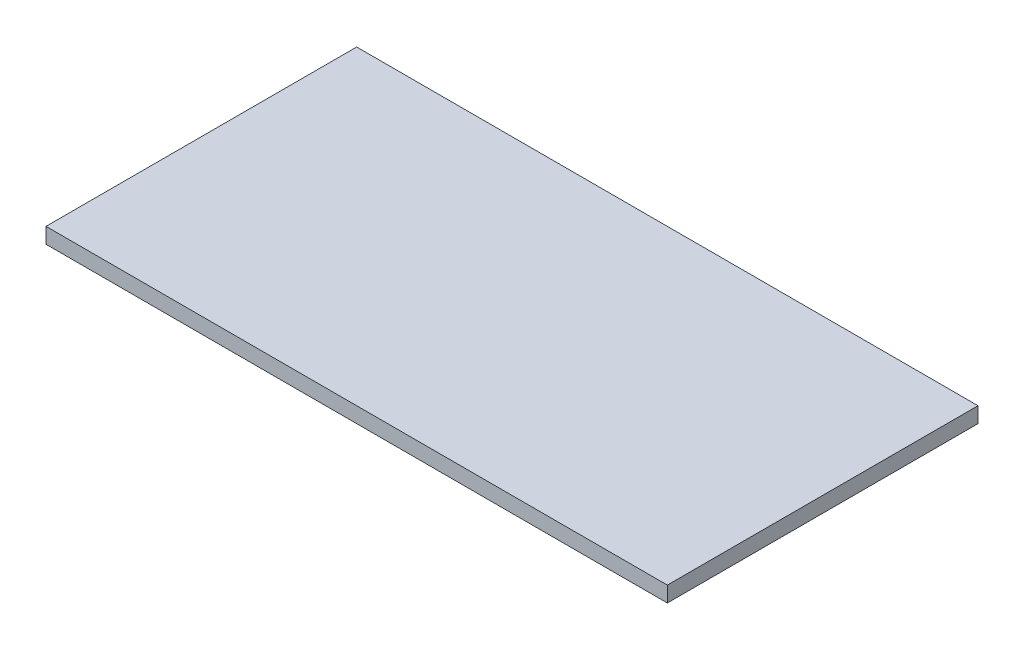
ISO-10303-21;
HEADER;
FILE_DESCRIPTION(('STEP AP214'),'2;1');
FILE_NAME('part.step','',(''),(''),'','','');
FILE_SCHEMA(('AUTOMOTIVE_DESIGN { 1 0 10303 214 1 1 1 1 }'));
ENDSEC;
DATA;
#1=APPLICATION_CONTEXT('core data for automotive mechanical design processes');
#2=APPLICATION_PROTOCOL_DEFINITION('international standard','automotive_design',2000,#1);
#3=PRODUCT_CONTEXT('',#1,'mechanical');
#4=PRODUCT('Part','Part','',(#3));
#5=PRODUCT_RELATED_PRODUCT_CATEGORY('part','',(#4));
#6=PRODUCT_DEFINITION_FORMATION('','',#4);
#7=PRODUCT_DEFINITION_CONTEXT('part definition',#1,'design');
#8=PRODUCT_DEFINITION('design','',#6,#7);
#9=PRODUCT_DEFINITION_SHAPE('','',#8);
#10=(LENGTH_UNIT() NAMED_UNIT(*) SI_UNIT(.MILLI.,.METRE.));
#11=(NAMED_UNIT(*) PLANE_ANGLE_UNIT() SI_UNIT($,.RADIAN.));
#12=(NAMED_UNIT(*) SI_UNIT($,.STERADIAN.) SOLID_ANGLE_UNIT());
#13=UNCERTAINTY_MEASURE_WITH_UNIT(LENGTH_MEASURE(1.E-05),#10,'distance_accuracy_value','');
#14=(GEOMETRIC_REPRESENTATION_CONTEXT(3) GLOBAL_UNCERTAINTY_ASSIGNED_CONTEXT((#13)) GLOBAL_UNIT_ASSIGNED_CONTEXT((#10,
#11,#12)) REPRESENTATION_CONTEXT('',''));
#15=CARTESIAN_POINT('',(0.,0.,0.));
#16=DIRECTION('',(0.,0.,1.));
#17=DIRECTION('',(1.,0.,0.));
#18=AXIS2_PLACEMENT_3D('',#15,#16,#17);
#19=CARTESIAN_POINT('',(-768.243243243243,30.,-282.77027027027));
#20=DIRECTION('',(1.,0.,0.));
#21=DIRECTION('',(0.,0.,-1.));
#22=AXIS2_PLACEMENT_3D('',#19,#20,#21);
#23=PLANE('',#22);
#24=DIRECTION('',(0.,0.,1.));
#25=VECTOR('',#24,1.);
#26=CARTESIAN_POINT('',(-768.243243243243,0.,-282.77027027027));
#27=LINE('',#26,#25);
#28=CARTESIAN_POINT('',(-768.243243243243,0.,-282.77027027027));
#29=VERTEX_POINT('',#28);
#30=CARTESIAN_POINT('',(-768.243243243243,0.,317.22972972973));
#31=VERTEX_POINT('',#30);
#32=EDGE_CURVE('E96',#29,#31,#27,.T.);
#33=ORIENTED_EDGE('',*,*,#32,.T.);
#34=DIRECTION('',(0.,-1.,0.));
#35=VECTOR('',#34,1.);
#36=CARTESIAN_POINT('',(-768.243243243243,30.,317.22972972973));
#37=LINE('',#36,#35);
#38=CARTESIAN_POINT('',(-768.243243243243,30.,317.22972972973));
#39=VERTEX_POINT('',#38);
#40=EDGE_CURVE('E11',#39,#31,#37,.T.);
#41=ORIENTED_EDGE('',*,*,#40,.F.);
#42=DIRECTION('',(0.,0.,1.));
#43=VECTOR('',#42,1.);
#44=CARTESIAN_POINT('',(-768.243243243243,30.,-282.77027027027));
#45=LINE('',#44,#43);
#46=CARTESIAN_POINT('',(-768.243243243243,30.,-282.77027027027));
#47=VERTEX_POINT('',#46);
#48=EDGE_CURVE('E84',#47,#39,#45,.T.);
#49=ORIENTED_EDGE('',*,*,#48,.F.);
#50=DIRECTION('',(0.,-1.,0.));
#51=VECTOR('',#50,1.);
#52=CARTESIAN_POINT('',(-768.243243243243,30.,-282.77027027027));
#53=LINE('',#52,#51);
#54=EDGE_CURVE('E92',#47,#29,#53,.T.);
#55=ORIENTED_EDGE('',*,*,#54,.T.);
#56=EDGE_LOOP('',(#33,#41,#49,#55));
#57=FACE_BOUND('',#56,.T.);
#58=ADVANCED_FACE('F33',(#57),#23,.F.);
#59=CARTESIAN_POINT('',(-768.243243243243,30.,317.22972972973));
#60=DIRECTION('',(0.,0.,-1.));
#61=DIRECTION('',(-1.,0.,0.));
#62=AXIS2_PLACEMENT_3D('',#59,#60,#61);
#63=PLANE('',#62);
#64=DIRECTION('',(1.,0.,0.));
#65=VECTOR('',#64,1.);
#66=CARTESIAN_POINT('',(-768.243243243243,0.,317.22972972973));
#67=LINE('',#66,#65);
#68=CARTESIAN_POINT('',(431.756756756756,0.,317.22972972973));
#69=VERTEX_POINT('',#68);
#70=EDGE_CURVE('E88',#31,#69,#67,.T.);
#71=ORIENTED_EDGE('',*,*,#70,.T.);
#72=DIRECTION('',(0.,-1.,0.));
#73=VECTOR('',#72,1.);
#74=CARTESIAN_POINT('',(431.756756756756,30.,317.22972972973));
#75=LINE('',#74,#73);
#76=CARTESIAN_POINT('',(431.756756756756,30.,317.22972972973));
#77=VERTEX_POINT('',#76);
#78=EDGE_CURVE('E41',#77,#69,#75,.T.);
#79=ORIENTED_EDGE('',*,*,#78,.F.);
#80=DIRECTION('',(1.,0.,0.));
#81=VECTOR('',#80,1.);
#82=CARTESIAN_POINT('',(-768.243243243243,30.,317.22972972973));
#83=LINE('',#82,#81);
#84=EDGE_CURVE('E79',#39,#77,#83,.T.);
#85=ORIENTED_EDGE('',*,*,#84,.F.);
#86=ORIENTED_EDGE('',*,*,#40,.T.);
#87=EDGE_LOOP('',(#71,#79,#85,#86));
#88=FACE_BOUND('',#87,.T.);
#89=ADVANCED_FACE('F87',(#88),#63,.F.);
#90=CARTESIAN_POINT('',(431.756756756756,30.,-282.77027027027));
#91=DIRECTION('',(-1.,0.,0.));
#92=DIRECTION('',(0.,0.,1.));
#93=AXIS2_PLACEMENT_3D('',#90,#91,#92);
#94=PLANE('',#93);
#95=DIRECTION('',(0.,0.,-1.));
#96=VECTOR('',#95,1.);
#97=CARTESIAN_POINT('',(431.756756756756,0.,-282.77027027027));
#98=LINE('',#97,#96);
#99=CARTESIAN_POINT('',(431.756756756756,0.,-282.77027027027));
#100=VERTEX_POINT('',#99);
#101=EDGE_CURVE('E66',#69,#100,#98,.T.);
#102=ORIENTED_EDGE('',*,*,#101,.T.);
#103=DIRECTION('',(0.,-1.,0.));
#104=VECTOR('',#103,1.);
#105=CARTESIAN_POINT('',(431.756756756756,30.,-282.77027027027));
#106=LINE('',#105,#104);
#107=CARTESIAN_POINT('',(431.756756756756,30.,-282.77027027027));
#108=VERTEX_POINT('',#107);
#109=EDGE_CURVE('E89',#108,#100,#106,.T.);
#110=ORIENTED_EDGE('',*,*,#109,.F.);
#111=DIRECTION('',(0.,0.,-1.));
#112=VECTOR('',#111,1.);
#113=CARTESIAN_POINT('',(431.756756756756,30.,-282.77027027027));
#114=LINE('',#113,#112);
#115=EDGE_CURVE('E82',#77,#108,#114,.T.);
#116=ORIENTED_EDGE('',*,*,#115,.F.);
#117=ORIENTED_EDGE('',*,*,#78,.T.);
#118=EDGE_LOOP('',(#102,#110,#116,#117));
#119=FACE_BOUND('',#118,.T.);
#120=ADVANCED_FACE('F90',(#119),#94,.F.);
#121=CARTESIAN_POINT('',(-768.243243243243,30.,-282.77027027027));
#122=DIRECTION('',(0.,0.,1.));
#123=DIRECTION('',(1.,0.,0.));
#124=AXIS2_PLACEMENT_3D('',#121,#122,#123);
#125=PLANE('',#124);
#126=DIRECTION('',(-1.,0.,0.));
#127=VECTOR('',#126,1.);
#128=CARTESIAN_POINT('',(-768.243243243243,0.,-282.77027027027));
#129=LINE('',#128,#127);
#130=EDGE_CURVE('E72',#100,#29,#129,.T.);
#131=ORIENTED_EDGE('',*,*,#130,.T.);
#132=ORIENTED_EDGE('',*,*,#54,.F.);
#133=DIRECTION('',(-1.,0.,0.));
#134=VECTOR('',#133,1.);
#135=CARTESIAN_POINT('',(-768.243243243243,30.,-282.77027027027));
#136=LINE('',#135,#134);
#137=EDGE_CURVE('E49',#108,#47,#136,.T.);
#138=ORIENTED_EDGE('',*,*,#137,.F.);
#139=ORIENTED_EDGE('',*,*,#109,.T.);
#140=EDGE_LOOP('',(#131,#132,#138,#139));
#141=FACE_BOUND('',#140,.T.);
#142=ADVANCED_FACE('F103',(#141),#125,.F.);
#143=CARTESIAN_POINT('',(0.,30.,0.));
#144=DIRECTION('',(0.,1.,0.));
#145=DIRECTION('',(0.,0.,1.));
#146=AXIS2_PLACEMENT_3D('',#143,#144,#145);
#147=PLANE('',#146);
#148=ORIENTED_EDGE('',*,*,#48,.T.);
#149=ORIENTED_EDGE('',*,*,#84,.T.);
#150=ORIENTED_EDGE('',*,*,#115,.T.);
#151=ORIENTED_EDGE('',*,*,#137,.T.);
#152=EDGE_LOOP('',(#148,#149,#150,#151));
#153=FACE_BOUND('',#152,.T.);
#154=ADVANCED_FACE('F80',(#153),#147,.T.);
#155=CARTESIAN_POINT('',(0.,0.,0.));
#156=DIRECTION('',(0.,1.,0.));
#157=DIRECTION('',(0.,0.,1.));
#158=AXIS2_PLACEMENT_3D('',#155,#156,#157);
#159=PLANE('',#158);
#160=ORIENTED_EDGE('',*,*,#32,.F.);
#161=ORIENTED_EDGE('',*,*,#130,.F.);
#162=ORIENTED_EDGE('',*,*,#101,.F.);
#163=ORIENTED_EDGE('',*,*,#70,.F.);
#164=EDGE_LOOP('',(#160,#161,#162,#163));
#165=FACE_BOUND('',#164,.T.);
#166=ADVANCED_FACE('F106',(#165),#159,.F.);
#167=CLOSED_SHELL('',(#58,#89,#120,#142,#154,#166));
#168=MANIFOLD_SOLID_BREP('B2',#167);
#169=ADVANCED_BREP_SHAPE_REPRESENTATION('',(#18,#168),#14);
#170=SHAPE_DEFINITION_REPRESENTATION(#9,#169);
ENDSEC;
END-ISO-10303-21;
